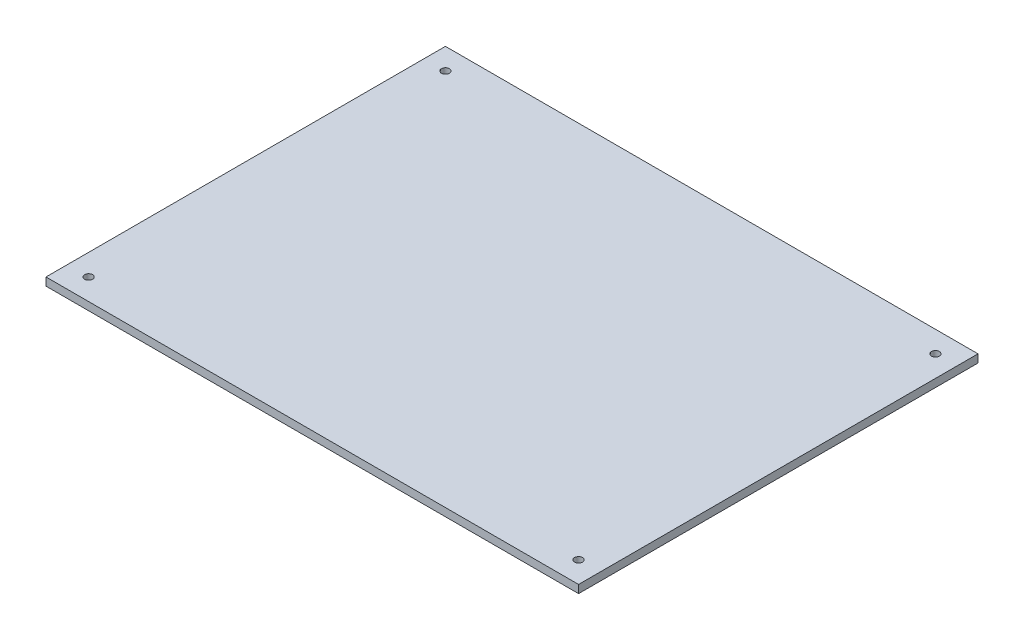
ISO-10303-21;
HEADER;
FILE_DESCRIPTION(('STEP AP214'),'2;1');
FILE_NAME('part.step','',(''),(''),'','','');
FILE_SCHEMA(('AUTOMOTIVE_DESIGN { 1 0 10303 214 1 1 1 1 }'));
ENDSEC;
DATA;
#1=APPLICATION_CONTEXT('core data for automotive mechanical design processes');
#2=APPLICATION_PROTOCOL_DEFINITION('international standard','automotive_design',2000,#1);
#3=PRODUCT_CONTEXT('',#1,'mechanical');
#4=PRODUCT('Part','Part','',(#3));
#5=PRODUCT_RELATED_PRODUCT_CATEGORY('part','',(#4));
#6=PRODUCT_DEFINITION_FORMATION('','',#4);
#7=PRODUCT_DEFINITION_CONTEXT('part definition',#1,'design');
#8=PRODUCT_DEFINITION('design','',#6,#7);
#9=PRODUCT_DEFINITION_SHAPE('','',#8);
#10=(LENGTH_UNIT() NAMED_UNIT(*) SI_UNIT(.MILLI.,.METRE.));
#11=(NAMED_UNIT(*) PLANE_ANGLE_UNIT() SI_UNIT($,.RADIAN.));
#12=(NAMED_UNIT(*) SI_UNIT($,.STERADIAN.) SOLID_ANGLE_UNIT());
#13=UNCERTAINTY_MEASURE_WITH_UNIT(LENGTH_MEASURE(1.E-05),#10,'distance_accuracy_value','');
#14=(GEOMETRIC_REPRESENTATION_CONTEXT(3) GLOBAL_UNCERTAINTY_ASSIGNED_CONTEXT((#13)) GLOBAL_UNIT_ASSIGNED_CONTEXT((#10,
#11,#12)) REPRESENTATION_CONTEXT('',''));
#15=CARTESIAN_POINT('',(0.,0.,0.));
#16=DIRECTION('',(0.,0.,1.));
#17=DIRECTION('',(1.,0.,0.));
#18=AXIS2_PLACEMENT_3D('',#15,#16,#17);
#19=CARTESIAN_POINT('',(0.,3.,0.));
#20=DIRECTION('',(0.,1.,0.));
#21=DIRECTION('',(0.,0.,1.));
#22=AXIS2_PLACEMENT_3D('',#19,#20,#21);
#23=PLANE('',#22);
#24=CARTESIAN_POINT('',(87.910463027642,3.,58.4772727272728));
#25=DIRECTION('',(0.,1.,0.));
#26=DIRECTION('',(0.,0.,1.));
#27=AXIS2_PLACEMENT_3D('',#24,#25,#26);
#28=CIRCLE('',#27,1.5);
#29=CARTESIAN_POINT('',(87.910463027642,3.,59.9772727272728));
#30=VERTEX_POINT('',#29);
#31=EDGE_CURVE('E127',#30,#30,#28,.T.);
#32=ORIENTED_EDGE('',*,*,#31,.F.);
#33=EDGE_LOOP('',(#32));
#34=FACE_BOUND('',#33,.T.);
#35=CARTESIAN_POINT('',(-96.0895369723581,3.,-75.5227272727272));
#36=DIRECTION('',(0.,1.,0.));
#37=DIRECTION('',(0.,0.,1.));
#38=AXIS2_PLACEMENT_3D('',#35,#36,#37);
#39=CIRCLE('',#38,1.5);
#40=CARTESIAN_POINT('',(-96.0895369723581,3.,-74.0227272727272));
#41=VERTEX_POINT('',#40);
#42=EDGE_CURVE('E106',#41,#41,#39,.T.);
#43=ORIENTED_EDGE('',*,*,#42,.F.);
#44=EDGE_LOOP('',(#43));
#45=FACE_BOUND('',#44,.T.);
#46=DIRECTION('',(0.,0.,1.));
#47=VECTOR('',#46,1.);
#48=CARTESIAN_POINT('',(-104.089536972358,3.,-83.5227272727272));
#49=LINE('',#48,#47);
#50=CARTESIAN_POINT('',(-104.089536972358,3.,-83.5227272727272));
#51=VERTEX_POINT('',#50);
#52=CARTESIAN_POINT('',(-104.089536972358,3.,66.4772727272728));
#53=VERTEX_POINT('',#52);
#54=EDGE_CURVE('E91',#51,#53,#49,.T.);
#55=ORIENTED_EDGE('',*,*,#54,.T.);
#56=DIRECTION('',(1.,0.,0.));
#57=VECTOR('',#56,1.);
#58=CARTESIAN_POINT('',(-104.089536972358,3.,66.4772727272728));
#59=LINE('',#58,#57);
#60=CARTESIAN_POINT('',(95.910463027642,3.,66.4772727272728));
#61=VERTEX_POINT('',#60);
#62=EDGE_CURVE('E86',#53,#61,#59,.T.);
#63=ORIENTED_EDGE('',*,*,#62,.T.);
#64=DIRECTION('',(0.,0.,-1.));
#65=VECTOR('',#64,1.);
#66=CARTESIAN_POINT('',(95.910463027642,3.,-83.5227272727272));
#67=LINE('',#66,#65);
#68=CARTESIAN_POINT('',(95.910463027642,3.,-83.5227272727272));
#69=VERTEX_POINT('',#68);
#70=EDGE_CURVE('E89',#61,#69,#67,.T.);
#71=ORIENTED_EDGE('',*,*,#70,.T.);
#72=DIRECTION('',(-1.,0.,0.));
#73=VECTOR('',#72,1.);
#74=CARTESIAN_POINT('',(-104.089536972358,3.,-83.5227272727272));
#75=LINE('',#74,#73);
#76=EDGE_CURVE('E56',#69,#51,#75,.T.);
#77=ORIENTED_EDGE('',*,*,#76,.T.);
#78=EDGE_LOOP('',(#55,#63,#71,#77));
#79=FACE_BOUND('',#78,.T.);
#80=CARTESIAN_POINT('',(-96.0895369723581,3.,58.4772727272728));
#81=DIRECTION('',(0.,1.,0.));
#82=DIRECTION('',(0.,0.,1.));
#83=AXIS2_PLACEMENT_3D('',#80,#81,#82);
#84=CIRCLE('',#83,1.5);
#85=CARTESIAN_POINT('',(-96.0895369723581,3.,59.9772727272728));
#86=VERTEX_POINT('',#85);
#87=EDGE_CURVE('E121',#86,#86,#84,.T.);
#88=ORIENTED_EDGE('',*,*,#87,.F.);
#89=EDGE_LOOP('',(#88));
#90=FACE_BOUND('',#89,.T.);
#91=CARTESIAN_POINT('',(87.910463027642,3.,-75.5227272727272));
#92=DIRECTION('',(0.,1.,0.));
#93=DIRECTION('',(0.,0.,1.));
#94=AXIS2_PLACEMENT_3D('',#91,#92,#93);
#95=CIRCLE('',#94,1.5);
#96=CARTESIAN_POINT('',(87.910463027642,3.,-74.0227272727272));
#97=VERTEX_POINT('',#96);
#98=EDGE_CURVE('E133',#97,#97,#95,.T.);
#99=ORIENTED_EDGE('',*,*,#98,.F.);
#100=EDGE_LOOP('',(#99));
#101=FACE_BOUND('',#100,.T.);
#102=ADVANCED_FACE('F39',(#34,#45,#79,#90,#101),#23,.T.);
#103=CARTESIAN_POINT('',(0.,0.,0.));
#104=DIRECTION('',(0.,1.,0.));
#105=DIRECTION('',(0.,0.,1.));
#106=AXIS2_PLACEMENT_3D('',#103,#104,#105);
#107=PLANE('',#106);
#108=DIRECTION('',(0.,0.,1.));
#109=VECTOR('',#108,1.);
#110=CARTESIAN_POINT('',(-104.089536972358,0.,-83.5227272727272));
#111=LINE('',#110,#109);
#112=CARTESIAN_POINT('',(-104.089536972358,0.,-83.5227272727272));
#113=VERTEX_POINT('',#112);
#114=CARTESIAN_POINT('',(-104.089536972358,0.,66.4772727272728));
#115=VERTEX_POINT('',#114);
#116=EDGE_CURVE('E103',#113,#115,#111,.T.);
#117=ORIENTED_EDGE('',*,*,#116,.F.);
#118=DIRECTION('',(-1.,0.,0.));
#119=VECTOR('',#118,1.);
#120=CARTESIAN_POINT('',(-104.089536972358,0.,-83.5227272727272));
#121=LINE('',#120,#119);
#122=CARTESIAN_POINT('',(95.910463027642,0.,-83.5227272727272));
#123=VERTEX_POINT('',#122);
#124=EDGE_CURVE('E79',#123,#113,#121,.T.);
#125=ORIENTED_EDGE('',*,*,#124,.F.);
#126=DIRECTION('',(0.,0.,-1.));
#127=VECTOR('',#126,1.);
#128=CARTESIAN_POINT('',(95.910463027642,0.,-83.5227272727272));
#129=LINE('',#128,#127);
#130=CARTESIAN_POINT('',(95.910463027642,0.,66.4772727272728));
#131=VERTEX_POINT('',#130);
#132=EDGE_CURVE('E73',#131,#123,#129,.T.);
#133=ORIENTED_EDGE('',*,*,#132,.F.);
#134=DIRECTION('',(1.,0.,0.));
#135=VECTOR('',#134,1.);
#136=CARTESIAN_POINT('',(-104.089536972358,0.,66.4772727272728));
#137=LINE('',#136,#135);
#138=EDGE_CURVE('E95',#115,#131,#137,.T.);
#139=ORIENTED_EDGE('',*,*,#138,.F.);
#140=EDGE_LOOP('',(#117,#125,#133,#139));
#141=FACE_BOUND('',#140,.T.);
#142=CARTESIAN_POINT('',(-96.0895369723581,0.,-75.5227272727272));
#143=DIRECTION('',(0.,1.,0.));
#144=DIRECTION('',(0.,0.,1.));
#145=AXIS2_PLACEMENT_3D('',#142,#143,#144);
#146=CIRCLE('',#145,1.5);
#147=CARTESIAN_POINT('',(-96.0895369723581,0.,-74.0227272727272));
#148=VERTEX_POINT('',#147);
#149=EDGE_CURVE('E118',#148,#148,#146,.T.);
#150=ORIENTED_EDGE('',*,*,#149,.T.);
#151=EDGE_LOOP('',(#150));
#152=FACE_BOUND('',#151,.T.);
#153=CARTESIAN_POINT('',(-96.0895369723581,0.,58.4772727272728));
#154=DIRECTION('',(0.,1.,0.));
#155=DIRECTION('',(0.,0.,1.));
#156=AXIS2_PLACEMENT_3D('',#153,#154,#155);
#157=CIRCLE('',#156,1.5);
#158=CARTESIAN_POINT('',(-96.0895369723581,0.,59.9772727272728));
#159=VERTEX_POINT('',#158);
#160=EDGE_CURVE('E124',#159,#159,#157,.T.);
#161=ORIENTED_EDGE('',*,*,#160,.T.);
#162=EDGE_LOOP('',(#161));
#163=FACE_BOUND('',#162,.T.);
#164=CARTESIAN_POINT('',(87.910463027642,0.,58.4772727272728));
#165=DIRECTION('',(0.,1.,0.));
#166=DIRECTION('',(0.,0.,1.));
#167=AXIS2_PLACEMENT_3D('',#164,#165,#166);
#168=CIRCLE('',#167,1.5);
#169=CARTESIAN_POINT('',(87.910463027642,0.,59.9772727272728));
#170=VERTEX_POINT('',#169);
#171=EDGE_CURVE('E130',#170,#170,#168,.T.);
#172=ORIENTED_EDGE('',*,*,#171,.T.);
#173=EDGE_LOOP('',(#172));
#174=FACE_BOUND('',#173,.T.);
#175=CARTESIAN_POINT('',(87.910463027642,0.,-75.5227272727272));
#176=DIRECTION('',(0.,1.,0.));
#177=DIRECTION('',(0.,0.,1.));
#178=AXIS2_PLACEMENT_3D('',#175,#176,#177);
#179=CIRCLE('',#178,1.5);
#180=CARTESIAN_POINT('',(87.910463027642,0.,-74.0227272727272));
#181=VERTEX_POINT('',#180);
#182=EDGE_CURVE('E136',#181,#181,#179,.T.);
#183=ORIENTED_EDGE('',*,*,#182,.T.);
#184=EDGE_LOOP('',(#183));
#185=FACE_BOUND('',#184,.T.);
#186=ADVANCED_FACE('F114',(#141,#152,#163,#174,#185),#107,.F.);
#187=CARTESIAN_POINT('',(-104.089536972358,3.,-83.5227272727272));
#188=DIRECTION('',(1.,0.,0.));
#189=DIRECTION('',(0.,0.,-1.));
#190=AXIS2_PLACEMENT_3D('',#187,#188,#189);
#191=PLANE('',#190);
#192=ORIENTED_EDGE('',*,*,#116,.T.);
#193=DIRECTION('',(0.,-1.,0.));
#194=VECTOR('',#193,1.);
#195=CARTESIAN_POINT('',(-104.089536972358,3.,66.4772727272728));
#196=LINE('',#195,#194);
#197=EDGE_CURVE('E11',#53,#115,#196,.T.);
#198=ORIENTED_EDGE('',*,*,#197,.F.);
#199=ORIENTED_EDGE('',*,*,#54,.F.);
#200=DIRECTION('',(0.,-1.,0.));
#201=VECTOR('',#200,1.);
#202=CARTESIAN_POINT('',(-104.089536972358,3.,-83.5227272727272));
#203=LINE('',#202,#201);
#204=EDGE_CURVE('E99',#51,#113,#203,.T.);
#205=ORIENTED_EDGE('',*,*,#204,.T.);
#206=EDGE_LOOP('',(#192,#198,#199,#205));
#207=FACE_BOUND('',#206,.T.);
#208=ADVANCED_FACE('F41',(#207),#191,.F.);
#209=CARTESIAN_POINT('',(-104.089536972358,3.,66.4772727272728));
#210=DIRECTION('',(0.,0.,-1.));
#211=DIRECTION('',(-1.,0.,0.));
#212=AXIS2_PLACEMENT_3D('',#209,#210,#211);
#213=PLANE('',#212);
#214=ORIENTED_EDGE('',*,*,#138,.T.);
#215=DIRECTION('',(0.,-1.,0.));
#216=VECTOR('',#215,1.);
#217=CARTESIAN_POINT('',(95.910463027642,3.,66.4772727272728));
#218=LINE('',#217,#216);
#219=EDGE_CURVE('E48',#61,#131,#218,.T.);
#220=ORIENTED_EDGE('',*,*,#219,.F.);
#221=ORIENTED_EDGE('',*,*,#62,.F.);
#222=ORIENTED_EDGE('',*,*,#197,.T.);
#223=EDGE_LOOP('',(#214,#220,#221,#222));
#224=FACE_BOUND('',#223,.T.);
#225=ADVANCED_FACE('F94',(#224),#213,.F.);
#226=CARTESIAN_POINT('',(95.910463027642,3.,-83.5227272727272));
#227=DIRECTION('',(-1.,0.,0.));
#228=DIRECTION('',(0.,0.,1.));
#229=AXIS2_PLACEMENT_3D('',#226,#227,#228);
#230=PLANE('',#229);
#231=ORIENTED_EDGE('',*,*,#132,.T.);
#232=DIRECTION('',(0.,-1.,0.));
#233=VECTOR('',#232,1.);
#234=CARTESIAN_POINT('',(95.910463027642,3.,-83.5227272727272));
#235=LINE('',#234,#233);
#236=EDGE_CURVE('E96',#69,#123,#235,.T.);
#237=ORIENTED_EDGE('',*,*,#236,.F.);
#238=ORIENTED_EDGE('',*,*,#70,.F.);
#239=ORIENTED_EDGE('',*,*,#219,.T.);
#240=EDGE_LOOP('',(#231,#237,#238,#239));
#241=FACE_BOUND('',#240,.T.);
#242=ADVANCED_FACE('F97',(#241),#230,.F.);
#243=CARTESIAN_POINT('',(-104.089536972358,3.,-83.5227272727272));
#244=DIRECTION('',(0.,0.,1.));
#245=DIRECTION('',(1.,0.,0.));
#246=AXIS2_PLACEMENT_3D('',#243,#244,#245);
#247=PLANE('',#246);
#248=ORIENTED_EDGE('',*,*,#124,.T.);
#249=ORIENTED_EDGE('',*,*,#204,.F.);
#250=ORIENTED_EDGE('',*,*,#76,.F.);
#251=ORIENTED_EDGE('',*,*,#236,.T.);
#252=EDGE_LOOP('',(#248,#249,#250,#251));
#253=FACE_BOUND('',#252,.T.);
#254=ADVANCED_FACE('F111',(#253),#247,.F.);
#255=CARTESIAN_POINT('',(-96.0895369723581,3.,-75.5227272727272));
#256=DIRECTION('',(0.,-1.,0.));
#257=DIRECTION('',(0.,0.,-1.));
#258=AXIS2_PLACEMENT_3D('',#255,#256,#257);
#259=CYLINDRICAL_SURFACE('',#258,1.5);
#260=ORIENTED_EDGE('',*,*,#42,.T.);
#261=EDGE_LOOP('',(#260));
#262=FACE_BOUND('',#261,.T.);
#263=ORIENTED_EDGE('',*,*,#149,.F.);
#264=EDGE_LOOP('',(#263));
#265=FACE_BOUND('',#264,.T.);
#266=ADVANCED_FACE('F155',(#262,#265),#259,.F.);
#267=CARTESIAN_POINT('',(-96.0895369723581,3.,58.4772727272728));
#268=DIRECTION('',(0.,-1.,0.));
#269=DIRECTION('',(0.,0.,-1.));
#270=AXIS2_PLACEMENT_3D('',#267,#268,#269);
#271=CYLINDRICAL_SURFACE('',#270,1.5);
#272=ORIENTED_EDGE('',*,*,#87,.T.);
#273=EDGE_LOOP('',(#272));
#274=FACE_BOUND('',#273,.T.);
#275=ORIENTED_EDGE('',*,*,#160,.F.);
#276=EDGE_LOOP('',(#275));
#277=FACE_BOUND('',#276,.T.);
#278=ADVANCED_FACE('F201',(#274,#277),#271,.F.);
#279=CARTESIAN_POINT('',(87.910463027642,3.,58.4772727272728));
#280=DIRECTION('',(0.,-1.,0.));
#281=DIRECTION('',(0.,0.,-1.));
#282=AXIS2_PLACEMENT_3D('',#279,#280,#281);
#283=CYLINDRICAL_SURFACE('',#282,1.5);
#284=ORIENTED_EDGE('',*,*,#31,.T.);
#285=EDGE_LOOP('',(#284));
#286=FACE_BOUND('',#285,.T.);
#287=ORIENTED_EDGE('',*,*,#171,.F.);
#288=EDGE_LOOP('',(#287));
#289=FACE_BOUND('',#288,.T.);
#290=ADVANCED_FACE('F209',(#286,#289),#283,.F.);
#291=CARTESIAN_POINT('',(87.910463027642,3.,-75.5227272727272));
#292=DIRECTION('',(0.,-1.,0.));
#293=DIRECTION('',(0.,0.,-1.));
#294=AXIS2_PLACEMENT_3D('',#291,#292,#293);
#295=CYLINDRICAL_SURFACE('',#294,1.5);
#296=ORIENTED_EDGE('',*,*,#98,.T.);
#297=EDGE_LOOP('',(#296));
#298=FACE_BOUND('',#297,.T.);
#299=ORIENTED_EDGE('',*,*,#182,.F.);
#300=EDGE_LOOP('',(#299));
#301=FACE_BOUND('',#300,.T.);
#302=ADVANCED_FACE('F142',(#298,#301),#295,.F.);
#303=CLOSED_SHELL('',(#102,#186,#208,#225,#242,#254,#266,#278,#290,#302));
#304=MANIFOLD_SOLID_BREP('B2',#303);
#305=ADVANCED_BREP_SHAPE_REPRESENTATION('',(#18,#304),#14);
#306=SHAPE_DEFINITION_REPRESENTATION(#9,#305);
ENDSEC;
END-ISO-10303-21;
